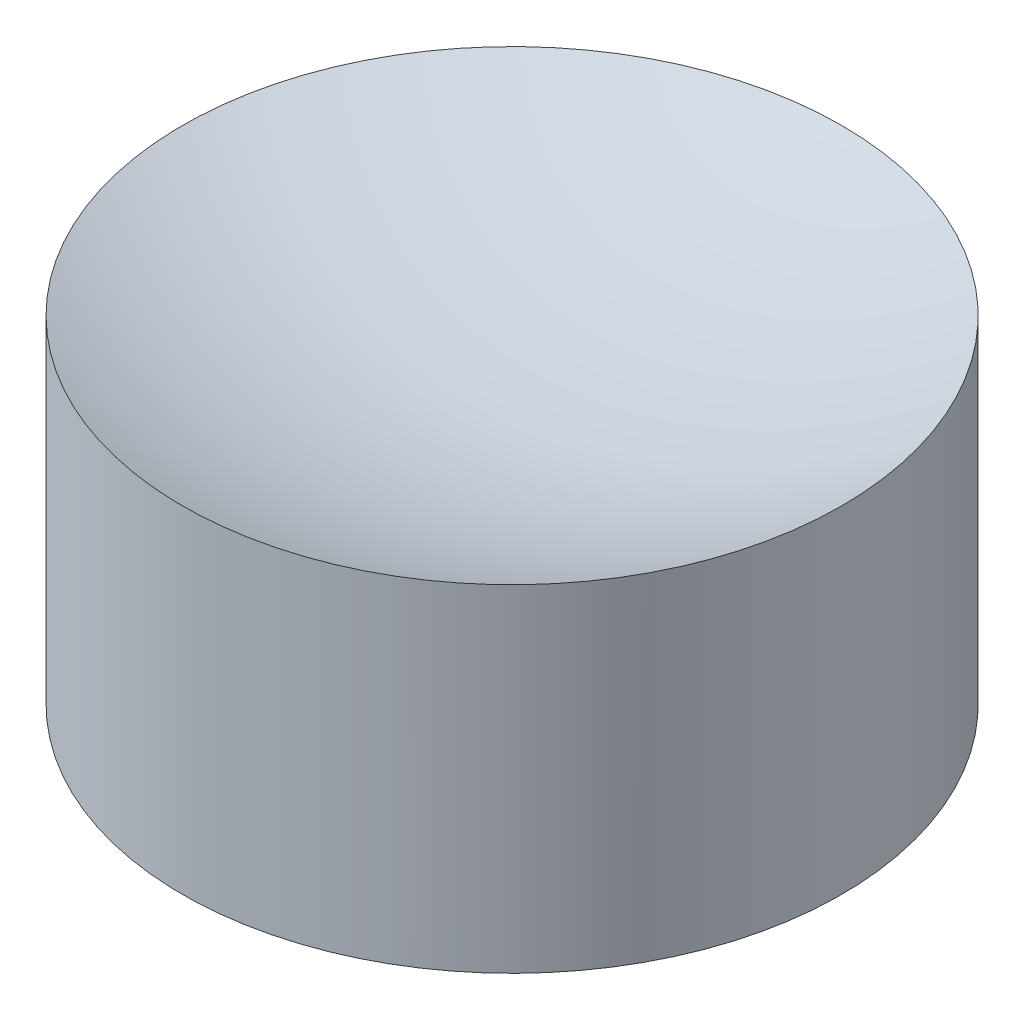
ISO-10303-21;
HEADER;
FILE_DESCRIPTION(('STEP AP214'),'2;1');
FILE_NAME('part.step','',(''),(''),'','','');
FILE_SCHEMA(('AUTOMOTIVE_DESIGN { 1 0 10303 214 1 1 1 1 }'));
ENDSEC;
DATA;
#1=APPLICATION_CONTEXT('core data for automotive mechanical design processes');
#2=APPLICATION_PROTOCOL_DEFINITION('international standard','automotive_design',2000,#1);
#3=PRODUCT_CONTEXT('',#1,'mechanical');
#4=PRODUCT('Part','Part','',(#3));
#5=PRODUCT_RELATED_PRODUCT_CATEGORY('part','',(#4));
#6=PRODUCT_DEFINITION_FORMATION('','',#4);
#7=PRODUCT_DEFINITION_CONTEXT('part definition',#1,'design');
#8=PRODUCT_DEFINITION('design','',#6,#7);
#9=PRODUCT_DEFINITION_SHAPE('','',#8);
#10=(LENGTH_UNIT() NAMED_UNIT(*) SI_UNIT(.MILLI.,.METRE.));
#11=(NAMED_UNIT(*) PLANE_ANGLE_UNIT() SI_UNIT($,.RADIAN.));
#12=(NAMED_UNIT(*) SI_UNIT($,.STERADIAN.) SOLID_ANGLE_UNIT());
#13=UNCERTAINTY_MEASURE_WITH_UNIT(LENGTH_MEASURE(1.E-05),#10,'distance_accuracy_value','');
#14=(GEOMETRIC_REPRESENTATION_CONTEXT(3) GLOBAL_UNCERTAINTY_ASSIGNED_CONTEXT((#13)) GLOBAL_UNIT_ASSIGNED_CONTEXT((#10,
#11,#12)) REPRESENTATION_CONTEXT('',''));
#15=CARTESIAN_POINT('',(0.,0.,0.));
#16=DIRECTION('',(0.,0.,1.));
#17=DIRECTION('',(1.,0.,0.));
#18=AXIS2_PLACEMENT_3D('',#15,#16,#17);
#19=CARTESIAN_POINT('',(0.,26.5,0.));
#20=DIRECTION('',(0.,-1.,0.));
#21=DIRECTION('',(1.,0.,0.));
#22=AXIS2_PLACEMENT_3D('',#19,#20,#21);
#23=SPHERICAL_SURFACE('',#22,20.);
#24=CARTESIAN_POINT('',(0.,8.16969722017664,0.));
#25=DIRECTION('',(0.,-1.,0.));
#26=DIRECTION('',(0.,0.,-1.));
#27=AXIS2_PLACEMENT_3D('',#24,#25,#26);
#28=CIRCLE('',#27,8.);
#29=CARTESIAN_POINT('',(0.,8.16969722017664,-8.));
#30=VERTEX_POINT('',#29);
#31=EDGE_CURVE('E56',#30,#30,#28,.T.);
#32=ORIENTED_EDGE('',*,*,#31,.F.);
#33=EDGE_LOOP('',(#32));
#34=FACE_BOUND('',#33,.T.);
#35=ADVANCED_FACE('F39',(#34),#23,.F.);
#36=CARTESIAN_POINT('',(0.,5.,0.));
#37=DIRECTION('',(0.,-1.,0.));
#38=DIRECTION('',(0.,0.,-1.));
#39=AXIS2_PLACEMENT_3D('',#36,#37,#38);
#40=PLANE('',#39);
#41=CARTESIAN_POINT('',(0.,5.,0.));
#42=DIRECTION('',(0.,-1.,0.));
#43=DIRECTION('',(0.,0.,-1.));
#44=AXIS2_PLACEMENT_3D('',#41,#42,#43);
#45=CIRCLE('',#44,1.5);
#46=CARTESIAN_POINT('',(0.,5.,-1.5));
#47=VERTEX_POINT('',#46);
#48=EDGE_CURVE('E10',#47,#47,#45,.T.);
#49=ORIENTED_EDGE('',*,*,#48,.T.);
#50=EDGE_LOOP('',(#49));
#51=FACE_BOUND('',#50,.T.);
#52=ADVANCED_FACE('F67',(#51),#40,.T.);
#53=CARTESIAN_POINT('',(0.,0.,0.));
#54=DIRECTION('',(0.,-1.,0.));
#55=DIRECTION('',(0.,0.,-1.));
#56=AXIS2_PLACEMENT_3D('',#53,#54,#55);
#57=CYLINDRICAL_SURFACE('',#56,1.5);
#58=ORIENTED_EDGE('',*,*,#48,.F.);
#59=EDGE_LOOP('',(#58));
#60=FACE_BOUND('',#59,.T.);
#61=CARTESIAN_POINT('',(0.,0.,0.));
#62=DIRECTION('',(0.,-1.,0.));
#63=DIRECTION('',(0.,0.,-1.));
#64=AXIS2_PLACEMENT_3D('',#61,#62,#63);
#65=CIRCLE('',#64,1.5);
#66=CARTESIAN_POINT('',(0.,0.,-1.5));
#67=VERTEX_POINT('',#66);
#68=EDGE_CURVE('E46',#67,#67,#65,.T.);
#69=ORIENTED_EDGE('',*,*,#68,.T.);
#70=EDGE_LOOP('',(#69));
#71=FACE_BOUND('',#70,.T.);
#72=ADVANCED_FACE('F71',(#60,#71),#57,.F.);
#73=CARTESIAN_POINT('',(0.,0.,0.));
#74=DIRECTION('',(0.,-1.,0.));
#75=DIRECTION('',(0.,0.,-1.));
#76=AXIS2_PLACEMENT_3D('',#73,#74,#75);
#77=PLANE('',#76);
#78=CARTESIAN_POINT('',(0.,0.,0.));
#79=DIRECTION('',(0.,-1.,0.));
#80=DIRECTION('',(0.,0.,-1.));
#81=AXIS2_PLACEMENT_3D('',#78,#79,#80);
#82=CIRCLE('',#81,8.);
#83=CARTESIAN_POINT('',(0.,0.,-8.));
#84=VERTEX_POINT('',#83);
#85=EDGE_CURVE('E51',#84,#84,#82,.T.);
#86=ORIENTED_EDGE('',*,*,#85,.T.);
#87=EDGE_LOOP('',(#86));
#88=FACE_BOUND('',#87,.T.);
#89=ORIENTED_EDGE('',*,*,#68,.F.);
#90=EDGE_LOOP('',(#89));
#91=FACE_BOUND('',#90,.T.);
#92=ADVANCED_FACE('F75',(#88,#91),#77,.T.);
#93=CARTESIAN_POINT('',(0.,0.,0.));
#94=DIRECTION('',(0.,-1.,0.));
#95=DIRECTION('',(0.,0.,-1.));
#96=AXIS2_PLACEMENT_3D('',#93,#94,#95);
#97=CYLINDRICAL_SURFACE('',#96,8.);
#98=ORIENTED_EDGE('',*,*,#31,.T.);
#99=EDGE_LOOP('',(#98));
#100=FACE_BOUND('',#99,.T.);
#101=ORIENTED_EDGE('',*,*,#85,.F.);
#102=EDGE_LOOP('',(#101));
#103=FACE_BOUND('',#102,.T.);
#104=ADVANCED_FACE('F63',(#100,#103),#97,.T.);
#105=CLOSED_SHELL('',(#35,#52,#72,#92,#104));
#106=MANIFOLD_SOLID_BREP('B2',#105);
#107=ADVANCED_BREP_SHAPE_REPRESENTATION('',(#18,#106),#14);
#108=SHAPE_DEFINITION_REPRESENTATION(#9,#107);
ENDSEC;
END-ISO-10303-21;
